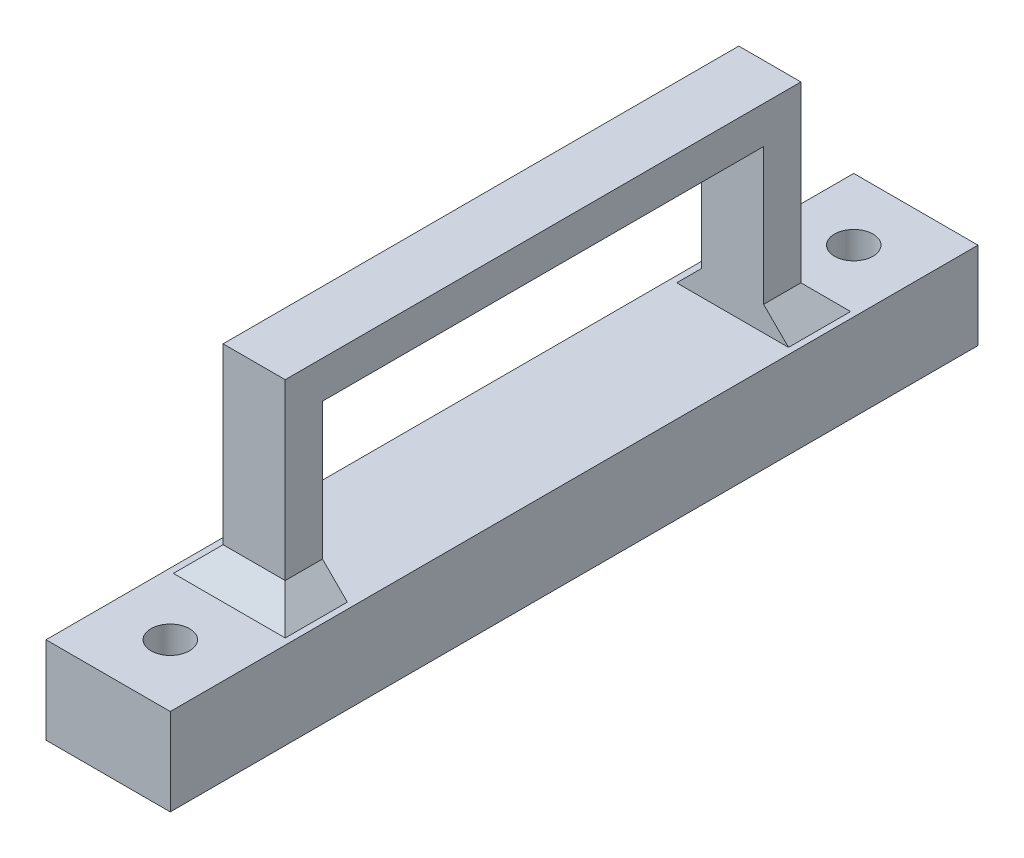
ISO-10303-21;
HEADER;
FILE_DESCRIPTION(('STEP AP214'),'2;1');
FILE_NAME('part.step','',(''),(''),'','','');
FILE_SCHEMA(('AUTOMOTIVE_DESIGN { 1 0 10303 214 1 1 1 1 }'));
ENDSEC;
DATA;
#1=APPLICATION_CONTEXT('core data for automotive mechanical design processes');
#2=APPLICATION_PROTOCOL_DEFINITION('international standard','automotive_design',2000,#1);
#3=PRODUCT_CONTEXT('',#1,'mechanical');
#4=PRODUCT('Part','Part','',(#3));
#5=PRODUCT_RELATED_PRODUCT_CATEGORY('part','',(#4));
#6=PRODUCT_DEFINITION_FORMATION('','',#4);
#7=PRODUCT_DEFINITION_CONTEXT('part definition',#1,'design');
#8=PRODUCT_DEFINITION('design','',#6,#7);
#9=PRODUCT_DEFINITION_SHAPE('','',#8);
#10=(LENGTH_UNIT() NAMED_UNIT(*) SI_UNIT(.MILLI.,.METRE.));
#11=(NAMED_UNIT(*) PLANE_ANGLE_UNIT() SI_UNIT($,.RADIAN.));
#12=(NAMED_UNIT(*) SI_UNIT($,.STERADIAN.) SOLID_ANGLE_UNIT());
#13=UNCERTAINTY_MEASURE_WITH_UNIT(LENGTH_MEASURE(1.E-05),#10,'distance_accuracy_value','');
#14=(GEOMETRIC_REPRESENTATION_CONTEXT(3) GLOBAL_UNCERTAINTY_ASSIGNED_CONTEXT((#13)) GLOBAL_UNIT_ASSIGNED_CONTEXT((#10,
#11,#12)) REPRESENTATION_CONTEXT('',''));
#15=CARTESIAN_POINT('',(0.,0.,0.));
#16=DIRECTION('',(0.,0.,1.));
#17=DIRECTION('',(1.,0.,0.));
#18=AXIS2_PLACEMENT_3D('',#15,#16,#17);
#19=CARTESIAN_POINT('',(7.50000000000001,23.,-50.25));
#20=DIRECTION('',(0.,0.,-1.));
#21=DIRECTION('',(-1.,0.,0.));
#22=AXIS2_PLACEMENT_3D('',#19,#20,#21);
#23=PLANE('',#22);
#24=DIRECTION('',(1.,0.,0.));
#25=VECTOR('',#24,1.);
#26=CARTESIAN_POINT('',(2.5,20.,-50.25));
#27=LINE('',#26,#25);
#28=CARTESIAN_POINT('',(2.5,20.,-50.25));
#29=VERTEX_POINT('',#28);
#30=CARTESIAN_POINT('',(7.50000000000001,20.,-50.25));
#31=VERTEX_POINT('',#30);
#32=EDGE_CURVE('E169',#29,#31,#27,.T.);
#33=ORIENTED_EDGE('',*,*,#32,.F.);
#34=DIRECTION('',(0.,-1.,0.));
#35=VECTOR('',#34,1.);
#36=CARTESIAN_POINT('',(2.5,23.,-50.25));
#37=LINE('',#36,#35);
#38=CARTESIAN_POINT('',(2.5,9.00000000000001,-50.25));
#39=VERTEX_POINT('',#38);
#40=EDGE_CURVE('E179',#29,#39,#37,.T.);
#41=ORIENTED_EDGE('',*,*,#40,.T.);
#42=DIRECTION('',(0.707106781186543,0.707106781186552,0.));
#43=VECTOR('',#42,1.);
#44=CARTESIAN_POINT('',(12.,18.5000000000001,-50.25));
#45=LINE('',#44,#43);
#46=CARTESIAN_POINT('',(0.500000000000007,7.,-50.25));
#47=VERTEX_POINT('',#46);
#48=EDGE_CURVE('E11',#39,#47,#45,.F.);
#49=ORIENTED_EDGE('',*,*,#48,.T.);
#50=DIRECTION('',(1.,0.,0.));
#51=VECTOR('',#50,1.);
#52=CARTESIAN_POINT('',(7.50000000000001,7.,-50.25));
#53=LINE('',#52,#51);
#54=CARTESIAN_POINT('',(9.49999999999999,7.,-50.25));
#55=VERTEX_POINT('',#54);
#56=EDGE_CURVE('E196',#47,#55,#53,.T.);
#57=ORIENTED_EDGE('',*,*,#56,.T.);
#58=DIRECTION('',(0.707106781186543,-0.707106781186552,0.));
#59=VECTOR('',#58,1.);
#60=CARTESIAN_POINT('',(0.500000000000012,16.0000000000001,-50.25));
#61=LINE('',#60,#59);
#62=CARTESIAN_POINT('',(7.50000000000001,9.00000000000001,-50.25));
#63=VERTEX_POINT('',#62);
#64=EDGE_CURVE('E53',#55,#63,#61,.F.);
#65=ORIENTED_EDGE('',*,*,#64,.T.);
#66=DIRECTION('',(0.,-1.,0.));
#67=VECTOR('',#66,1.);
#68=CARTESIAN_POINT('',(7.50000000000001,23.,-50.25));
#69=LINE('',#68,#67);
#70=EDGE_CURVE('E206',#31,#63,#69,.T.);
#71=ORIENTED_EDGE('',*,*,#70,.F.);
#72=EDGE_LOOP('',(#33,#41,#49,#57,#65,#71));
#73=FACE_BOUND('',#72,.T.);
#74=ADVANCED_FACE('F43',(#73),#23,.F.);
#75=CARTESIAN_POINT('',(7.50000000000001,23.,-14.75));
#76=DIRECTION('',(0.,0.,1.));
#77=DIRECTION('',(1.,0.,0.));
#78=AXIS2_PLACEMENT_3D('',#75,#76,#77);
#79=PLANE('',#78);
#80=DIRECTION('',(1.,0.,0.));
#81=VECTOR('',#80,1.);
#82=CARTESIAN_POINT('',(2.5,20.,-14.75));
#83=LINE('',#82,#81);
#84=CARTESIAN_POINT('',(2.5,20.,-14.75));
#85=VERTEX_POINT('',#84);
#86=CARTESIAN_POINT('',(7.50000000000001,20.,-14.75));
#87=VERTEX_POINT('',#86);
#88=EDGE_CURVE('E160',#85,#87,#83,.T.);
#89=ORIENTED_EDGE('',*,*,#88,.T.);
#90=DIRECTION('',(0.,-1.,0.));
#91=VECTOR('',#90,1.);
#92=CARTESIAN_POINT('',(7.50000000000001,23.,-14.75));
#93=LINE('',#92,#91);
#94=CARTESIAN_POINT('',(7.50000000000001,9.00000000000001,-14.75));
#95=VERTEX_POINT('',#94);
#96=EDGE_CURVE('E180',#87,#95,#93,.T.);
#97=ORIENTED_EDGE('',*,*,#96,.T.);
#98=DIRECTION('',(-0.707106781186543,0.707106781186552,0.));
#99=VECTOR('',#98,1.);
#100=CARTESIAN_POINT('',(0.500000000000042,16.0000000000001,-14.75));
#101=LINE('',#100,#99);
#102=CARTESIAN_POINT('',(9.50000000000005,7.,-14.75));
#103=VERTEX_POINT('',#102);
#104=EDGE_CURVE('E285',#95,#103,#101,.F.);
#105=ORIENTED_EDGE('',*,*,#104,.T.);
#106=DIRECTION('',(-1.,0.,0.));
#107=VECTOR('',#106,1.);
#108=CARTESIAN_POINT('',(7.50000000000001,7.,-14.75));
#109=LINE('',#108,#107);
#110=CARTESIAN_POINT('',(0.499999999999946,7.,-14.75));
#111=VERTEX_POINT('',#110);
#112=EDGE_CURVE('E194',#103,#111,#109,.T.);
#113=ORIENTED_EDGE('',*,*,#112,.T.);
#114=DIRECTION('',(-0.707106781186543,-0.707106781186552,0.));
#115=VECTOR('',#114,1.);
#116=CARTESIAN_POINT('',(11.9999999999999,18.5000000000001,-14.75));
#117=LINE('',#116,#115);
#118=CARTESIAN_POINT('',(2.5,9.00000000000001,-14.75));
#119=VERTEX_POINT('',#118);
#120=EDGE_CURVE('E184',#111,#119,#117,.F.);
#121=ORIENTED_EDGE('',*,*,#120,.T.);
#122=DIRECTION('',(0.,-1.,0.));
#123=VECTOR('',#122,1.);
#124=CARTESIAN_POINT('',(2.5,23.,-14.75));
#125=LINE('',#124,#123);
#126=EDGE_CURVE('E176',#85,#119,#125,.T.);
#127=ORIENTED_EDGE('',*,*,#126,.F.);
#128=EDGE_LOOP('',(#89,#97,#105,#113,#121,#127));
#129=FACE_BOUND('',#128,.T.);
#130=ADVANCED_FACE('F182',(#129),#79,.F.);
#131=CARTESIAN_POINT('',(0.,7.,0.));
#132=DIRECTION('',(0.,-1.,0.));
#133=DIRECTION('',(0.,0.,-1.));
#134=AXIS2_PLACEMENT_3D('',#131,#132,#133);
#135=PLANE('',#134);
#136=DIRECTION('',(0.,0.,1.));
#137=VECTOR('',#136,1.);
#138=CARTESIAN_POINT('',(9.49999999999999,7.,-50.25));
#139=LINE('',#138,#137);
#140=CARTESIAN_POINT('',(9.49999999999998,7.,-55.25));
#141=VERTEX_POINT('',#140);
#142=EDGE_CURVE('E266',#141,#55,#139,.T.);
#143=ORIENTED_EDGE('',*,*,#142,.T.);
#144=ORIENTED_EDGE('',*,*,#56,.F.);
#145=DIRECTION('',(0.,0.,-1.));
#146=VECTOR('',#145,1.);
#147=CARTESIAN_POINT('',(0.500000000000013,7.,-53.25));
#148=LINE('',#147,#146);
#149=CARTESIAN_POINT('',(0.500000000000016,7.,-55.25));
#150=VERTEX_POINT('',#149);
#151=EDGE_CURVE('E262',#47,#150,#148,.T.);
#152=ORIENTED_EDGE('',*,*,#151,.T.);
#153=DIRECTION('',(1.,0.,0.));
#154=VECTOR('',#153,1.);
#155=CARTESIAN_POINT('',(7.5,7.,-55.25));
#156=LINE('',#155,#154);
#157=EDGE_CURVE('E264',#150,#141,#156,.T.);
#158=ORIENTED_EDGE('',*,*,#157,.T.);
#159=EDGE_LOOP('',(#143,#144,#152,#158));
#160=FACE_BOUND('',#159,.T.);
#161=DIRECTION('',(0.,0.,1.));
#162=VECTOR('',#161,1.);
#163=CARTESIAN_POINT('',(0.,7.,0.));
#164=LINE('',#163,#162);
#165=CARTESIAN_POINT('',(0.,7.,-65.));
#166=VERTEX_POINT('',#165);
#167=CARTESIAN_POINT('',(0.,7.,0.));
#168=VERTEX_POINT('',#167);
#169=EDGE_CURVE('E229',#166,#168,#164,.T.);
#170=ORIENTED_EDGE('',*,*,#169,.T.);
#171=DIRECTION('',(1.,0.,0.));
#172=VECTOR('',#171,1.);
#173=CARTESIAN_POINT('',(0.,7.,0.));
#174=LINE('',#173,#172);
#175=CARTESIAN_POINT('',(10.,7.,0.));
#176=VERTEX_POINT('',#175);
#177=EDGE_CURVE('E232',#168,#176,#174,.T.);
#178=ORIENTED_EDGE('',*,*,#177,.T.);
#179=DIRECTION('',(0.,0.,-1.));
#180=VECTOR('',#179,1.);
#181=CARTESIAN_POINT('',(10.,7.,0.));
#182=LINE('',#181,#180);
#183=CARTESIAN_POINT('',(10.,7.,-65.));
#184=VERTEX_POINT('',#183);
#185=EDGE_CURVE('E235',#176,#184,#182,.T.);
#186=ORIENTED_EDGE('',*,*,#185,.T.);
#187=DIRECTION('',(-1.,0.,0.));
#188=VECTOR('',#187,1.);
#189=CARTESIAN_POINT('',(0.,7.,-65.));
#190=LINE('',#189,#188);
#191=EDGE_CURVE('E237',#184,#166,#190,.T.);
#192=ORIENTED_EDGE('',*,*,#191,.T.);
#193=EDGE_LOOP('',(#170,#178,#186,#192));
#194=FACE_BOUND('',#193,.T.);
#195=CARTESIAN_POINT('',(5.,7.,-60.));
#196=DIRECTION('',(0.,1.,0.));
#197=DIRECTION('',(0.,0.,1.));
#198=AXIS2_PLACEMENT_3D('',#195,#196,#197);
#199=CIRCLE('',#198,1.55);
#200=CARTESIAN_POINT('',(5.,7.,-58.45));
#201=VERTEX_POINT('',#200);
#202=EDGE_CURVE('E223',#201,#201,#199,.T.);
#203=ORIENTED_EDGE('',*,*,#202,.F.);
#204=EDGE_LOOP('',(#203));
#205=FACE_BOUND('',#204,.T.);
#206=CARTESIAN_POINT('',(5.,7.,-5.));
#207=DIRECTION('',(0.,1.,0.));
#208=DIRECTION('',(0.,0.,1.));
#209=AXIS2_PLACEMENT_3D('',#206,#207,#208);
#210=CIRCLE('',#209,1.55);
#211=CARTESIAN_POINT('',(5.,7.,-3.45));
#212=VERTEX_POINT('',#211);
#213=EDGE_CURVE('E217',#212,#212,#210,.T.);
#214=ORIENTED_EDGE('',*,*,#213,.F.);
#215=EDGE_LOOP('',(#214));
#216=FACE_BOUND('',#215,.T.);
#217=DIRECTION('',(0.,0.,-1.));
#218=VECTOR('',#217,1.);
#219=CARTESIAN_POINT('',(0.499999999999946,7.,-14.75));
#220=LINE('',#219,#218);
#221=CARTESIAN_POINT('',(0.499999999999937,7.,-9.75000000000001));
#222=VERTEX_POINT('',#221);
#223=EDGE_CURVE('E273',#222,#111,#220,.T.);
#224=ORIENTED_EDGE('',*,*,#223,.T.);
#225=ORIENTED_EDGE('',*,*,#112,.F.);
#226=DIRECTION('',(0.,0.,1.));
#227=VECTOR('',#226,1.);
#228=CARTESIAN_POINT('',(9.50000000000006,7.,-11.75));
#229=LINE('',#228,#227);
#230=CARTESIAN_POINT('',(9.50000000000006,7.,-9.75000000000001));
#231=VERTEX_POINT('',#230);
#232=EDGE_CURVE('E271',#103,#231,#229,.T.);
#233=ORIENTED_EDGE('',*,*,#232,.T.);
#234=DIRECTION('',(-1.,0.,0.));
#235=VECTOR('',#234,1.);
#236=CARTESIAN_POINT('',(2.5,7.,-9.75000000000001));
#237=LINE('',#236,#235);
#238=EDGE_CURVE('E269',#231,#222,#237,.T.);
#239=ORIENTED_EDGE('',*,*,#238,.T.);
#240=EDGE_LOOP('',(#224,#225,#233,#239));
#241=FACE_BOUND('',#240,.T.);
#242=ADVANCED_FACE('F320',(#160,#194,#205,#216,#241),#135,.F.);
#243=CARTESIAN_POINT('',(0.,0.,0.));
#244=DIRECTION('',(0.,-1.,0.));
#245=DIRECTION('',(0.,0.,-1.));
#246=AXIS2_PLACEMENT_3D('',#243,#244,#245);
#247=PLANE('',#246);
#248=CARTESIAN_POINT('',(5.,0.,-60.));
#249=DIRECTION('',(0.,1.,0.));
#250=DIRECTION('',(0.,0.,1.));
#251=AXIS2_PLACEMENT_3D('',#248,#249,#250);
#252=CIRCLE('',#251,1.55);
#253=CARTESIAN_POINT('',(5.,0.,-58.45));
#254=VERTEX_POINT('',#253);
#255=EDGE_CURVE('E220',#254,#254,#252,.T.);
#256=ORIENTED_EDGE('',*,*,#255,.T.);
#257=EDGE_LOOP('',(#256));
#258=FACE_BOUND('',#257,.T.);
#259=DIRECTION('',(0.,0.,1.));
#260=VECTOR('',#259,1.);
#261=CARTESIAN_POINT('',(0.,0.,0.));
#262=LINE('',#261,#260);
#263=CARTESIAN_POINT('',(0.,0.,-65.));
#264=VERTEX_POINT('',#263);
#265=CARTESIAN_POINT('',(0.,0.,0.));
#266=VERTEX_POINT('',#265);
#267=EDGE_CURVE('E226',#264,#266,#262,.T.);
#268=ORIENTED_EDGE('',*,*,#267,.F.);
#269=DIRECTION('',(-1.,0.,0.));
#270=VECTOR('',#269,1.);
#271=CARTESIAN_POINT('',(0.,0.,-65.));
#272=LINE('',#271,#270);
#273=CARTESIAN_POINT('',(10.,0.,-65.));
#274=VERTEX_POINT('',#273);
#275=EDGE_CURVE('E233',#274,#264,#272,.T.);
#276=ORIENTED_EDGE('',*,*,#275,.F.);
#277=DIRECTION('',(0.,0.,-1.));
#278=VECTOR('',#277,1.);
#279=CARTESIAN_POINT('',(10.,0.,0.));
#280=LINE('',#279,#278);
#281=CARTESIAN_POINT('',(10.,0.,0.));
#282=VERTEX_POINT('',#281);
#283=EDGE_CURVE('E244',#282,#274,#280,.T.);
#284=ORIENTED_EDGE('',*,*,#283,.F.);
#285=DIRECTION('',(1.,0.,0.));
#286=VECTOR('',#285,1.);
#287=CARTESIAN_POINT('',(0.,0.,0.));
#288=LINE('',#287,#286);
#289=EDGE_CURVE('E242',#266,#282,#288,.T.);
#290=ORIENTED_EDGE('',*,*,#289,.F.);
#291=EDGE_LOOP('',(#268,#276,#284,#290));
#292=FACE_BOUND('',#291,.T.);
#293=CARTESIAN_POINT('',(5.,0.,-5.));
#294=DIRECTION('',(0.,1.,0.));
#295=DIRECTION('',(0.,0.,1.));
#296=AXIS2_PLACEMENT_3D('',#293,#294,#295);
#297=CIRCLE('',#296,1.55);
#298=CARTESIAN_POINT('',(5.,0.,-3.45));
#299=VERTEX_POINT('',#298);
#300=EDGE_CURVE('E216',#299,#299,#297,.T.);
#301=ORIENTED_EDGE('',*,*,#300,.T.);
#302=EDGE_LOOP('',(#301));
#303=FACE_BOUND('',#302,.T.);
#304=ADVANCED_FACE('F340',(#258,#292,#303),#247,.T.);
#305=CARTESIAN_POINT('',(0.,7.,0.));
#306=DIRECTION('',(1.,0.,0.));
#307=DIRECTION('',(0.,0.,-1.));
#308=AXIS2_PLACEMENT_3D('',#305,#306,#307);
#309=PLANE('',#308);
#310=ORIENTED_EDGE('',*,*,#267,.T.);
#311=DIRECTION('',(0.,-1.,0.));
#312=VECTOR('',#311,1.);
#313=CARTESIAN_POINT('',(0.,7.,0.));
#314=LINE('',#313,#312);
#315=EDGE_CURVE('E255',#168,#266,#314,.T.);
#316=ORIENTED_EDGE('',*,*,#315,.F.);
#317=ORIENTED_EDGE('',*,*,#169,.F.);
#318=DIRECTION('',(0.,-1.,0.));
#319=VECTOR('',#318,1.);
#320=CARTESIAN_POINT('',(0.,7.,-65.));
#321=LINE('',#320,#319);
#322=EDGE_CURVE('E239',#166,#264,#321,.T.);
#323=ORIENTED_EDGE('',*,*,#322,.T.);
#324=EDGE_LOOP('',(#310,#316,#317,#323));
#325=FACE_BOUND('',#324,.T.);
#326=ADVANCED_FACE('F357',(#325),#309,.F.);
#327=CARTESIAN_POINT('',(0.,7.,0.));
#328=DIRECTION('',(0.,0.,-1.));
#329=DIRECTION('',(-1.,0.,0.));
#330=AXIS2_PLACEMENT_3D('',#327,#328,#329);
#331=PLANE('',#330);
#332=ORIENTED_EDGE('',*,*,#289,.T.);
#333=DIRECTION('',(0.,-1.,0.));
#334=VECTOR('',#333,1.);
#335=CARTESIAN_POINT('',(10.,7.,0.));
#336=LINE('',#335,#334);
#337=EDGE_CURVE('E252',#176,#282,#336,.T.);
#338=ORIENTED_EDGE('',*,*,#337,.F.);
#339=ORIENTED_EDGE('',*,*,#177,.F.);
#340=ORIENTED_EDGE('',*,*,#315,.T.);
#341=EDGE_LOOP('',(#332,#338,#339,#340));
#342=FACE_BOUND('',#341,.T.);
#343=ADVANCED_FACE('F363',(#342),#331,.F.);
#344=CARTESIAN_POINT('',(10.,7.,0.));
#345=DIRECTION('',(-1.,0.,0.));
#346=DIRECTION('',(0.,0.,1.));
#347=AXIS2_PLACEMENT_3D('',#344,#345,#346);
#348=PLANE('',#347);
#349=ORIENTED_EDGE('',*,*,#283,.T.);
#350=DIRECTION('',(0.,-1.,0.));
#351=VECTOR('',#350,1.);
#352=CARTESIAN_POINT('',(10.,7.,-65.));
#353=LINE('',#352,#351);
#354=EDGE_CURVE('E249',#184,#274,#353,.T.);
#355=ORIENTED_EDGE('',*,*,#354,.F.);
#356=ORIENTED_EDGE('',*,*,#185,.F.);
#357=ORIENTED_EDGE('',*,*,#337,.T.);
#358=EDGE_LOOP('',(#349,#355,#356,#357));
#359=FACE_BOUND('',#358,.T.);
#360=ADVANCED_FACE('F389',(#359),#348,.F.);
#361=CARTESIAN_POINT('',(0.,7.,-65.));
#362=DIRECTION('',(0.,0.,1.));
#363=DIRECTION('',(1.,0.,0.));
#364=AXIS2_PLACEMENT_3D('',#361,#362,#363);
#365=PLANE('',#364);
#366=ORIENTED_EDGE('',*,*,#275,.T.);
#367=ORIENTED_EDGE('',*,*,#322,.F.);
#368=ORIENTED_EDGE('',*,*,#191,.F.);
#369=ORIENTED_EDGE('',*,*,#354,.T.);
#370=EDGE_LOOP('',(#366,#367,#368,#369));
#371=FACE_BOUND('',#370,.T.);
#372=ADVANCED_FACE('F384',(#371),#365,.F.);
#373=CARTESIAN_POINT('',(5.,7.,-60.));
#374=DIRECTION('',(0.,-1.,0.));
#375=DIRECTION('',(0.,0.,-1.));
#376=AXIS2_PLACEMENT_3D('',#373,#374,#375);
#377=CYLINDRICAL_SURFACE('',#376,1.55);
#378=ORIENTED_EDGE('',*,*,#202,.T.);
#379=EDGE_LOOP('',(#378));
#380=FACE_BOUND('',#379,.T.);
#381=ORIENTED_EDGE('',*,*,#255,.F.);
#382=EDGE_LOOP('',(#381));
#383=FACE_BOUND('',#382,.T.);
#384=ADVANCED_FACE('F352',(#380,#383),#377,.F.);
#385=CARTESIAN_POINT('',(5.,7.,-5.));
#386=DIRECTION('',(0.,-1.,0.));
#387=DIRECTION('',(0.,0.,-1.));
#388=AXIS2_PLACEMENT_3D('',#385,#386,#387);
#389=CYLINDRICAL_SURFACE('',#388,1.55);
#390=ORIENTED_EDGE('',*,*,#213,.T.);
#391=EDGE_LOOP('',(#390));
#392=FACE_BOUND('',#391,.T.);
#393=ORIENTED_EDGE('',*,*,#300,.F.);
#394=EDGE_LOOP('',(#393));
#395=FACE_BOUND('',#394,.T.);
#396=ADVANCED_FACE('F349',(#392,#395),#389,.F.);
#397=CARTESIAN_POINT('',(7.5,23.,-53.25));
#398=DIRECTION('',(-1.,0.,0.));
#399=DIRECTION('',(0.,0.,1.));
#400=AXIS2_PLACEMENT_3D('',#397,#398,#399);
#401=PLANE('',#400);
#402=DIRECTION('',(0.,-1.,0.));
#403=VECTOR('',#402,1.);
#404=CARTESIAN_POINT('',(7.5,23.,-11.75));
#405=LINE('',#404,#403);
#406=CARTESIAN_POINT('',(7.5,23.,-11.75));
#407=VERTEX_POINT('',#406);
#408=CARTESIAN_POINT('',(7.5,9.00000000000001,-11.75));
#409=VERTEX_POINT('',#408);
#410=EDGE_CURVE('E188',#407,#409,#405,.T.);
#411=ORIENTED_EDGE('',*,*,#410,.T.);
#412=DIRECTION('',(0.,0.,-1.));
#413=VECTOR('',#412,1.);
#414=CARTESIAN_POINT('',(7.50000000000007,9.00000000000001,-14.75));
#415=LINE('',#414,#413);
#416=EDGE_CURVE('E68',#409,#95,#415,.T.);
#417=ORIENTED_EDGE('',*,*,#416,.T.);
#418=ORIENTED_EDGE('',*,*,#96,.F.);
#419=DIRECTION('',(0.,0.,-1.));
#420=VECTOR('',#419,1.);
#421=CARTESIAN_POINT('',(7.50000000000001,20.,-14.75));
#422=LINE('',#421,#420);
#423=EDGE_CURVE('E166',#87,#31,#422,.T.);
#424=ORIENTED_EDGE('',*,*,#423,.T.);
#425=ORIENTED_EDGE('',*,*,#70,.T.);
#426=DIRECTION('',(0.,0.,-1.));
#427=VECTOR('',#426,1.);
#428=CARTESIAN_POINT('',(7.5,9.00000000000001,-53.25));
#429=LINE('',#428,#427);
#430=CARTESIAN_POINT('',(7.5,9.00000000000001,-53.25));
#431=VERTEX_POINT('',#430);
#432=EDGE_CURVE('E276',#63,#431,#429,.T.);
#433=ORIENTED_EDGE('',*,*,#432,.T.);
#434=DIRECTION('',(0.,-1.,0.));
#435=VECTOR('',#434,1.);
#436=CARTESIAN_POINT('',(7.5,23.,-53.25));
#437=LINE('',#436,#435);
#438=CARTESIAN_POINT('',(7.5,23.,-53.25));
#439=VERTEX_POINT('',#438);
#440=EDGE_CURVE('E213',#439,#431,#437,.T.);
#441=ORIENTED_EDGE('',*,*,#440,.F.);
#442=DIRECTION('',(0.,0.,-1.));
#443=VECTOR('',#442,1.);
#444=CARTESIAN_POINT('',(7.5,23.,-53.25));
#445=LINE('',#444,#443);
#446=EDGE_CURVE('E199',#407,#439,#445,.T.);
#447=ORIENTED_EDGE('',*,*,#446,.F.);
#448=EDGE_LOOP('',(#411,#417,#418,#424,#425,#433,#441,#447));
#449=FACE_BOUND('',#448,.T.);
#450=ADVANCED_FACE('F312',(#449),#401,.F.);
#451=CARTESIAN_POINT('',(7.5,23.,-53.25));
#452=DIRECTION('',(0.,0.,1.));
#453=DIRECTION('',(1.,0.,0.));
#454=AXIS2_PLACEMENT_3D('',#451,#452,#453);
#455=PLANE('',#454);
#456=ORIENTED_EDGE('',*,*,#440,.T.);
#457=DIRECTION('',(-1.,0.,0.));
#458=VECTOR('',#457,1.);
#459=CARTESIAN_POINT('',(2.5,9.00000000000001,-53.25));
#460=LINE('',#459,#458);
#461=CARTESIAN_POINT('',(2.5,9.00000000000001,-53.25));
#462=VERTEX_POINT('',#461);
#463=EDGE_CURVE('E282',#431,#462,#460,.T.);
#464=ORIENTED_EDGE('',*,*,#463,.T.);
#465=DIRECTION('',(0.,-1.,0.));
#466=VECTOR('',#465,1.);
#467=CARTESIAN_POINT('',(2.5,23.,-53.25));
#468=LINE('',#467,#466);
#469=CARTESIAN_POINT('',(2.5,23.,-53.25));
#470=VERTEX_POINT('',#469);
#471=EDGE_CURVE('E210',#470,#462,#468,.T.);
#472=ORIENTED_EDGE('',*,*,#471,.F.);
#473=DIRECTION('',(-1.,0.,0.));
#474=VECTOR('',#473,1.);
#475=CARTESIAN_POINT('',(7.5,23.,-53.25));
#476=LINE('',#475,#474);
#477=EDGE_CURVE('E202',#439,#470,#476,.T.);
#478=ORIENTED_EDGE('',*,*,#477,.F.);
#479=EDGE_LOOP('',(#456,#464,#472,#478));
#480=FACE_BOUND('',#479,.T.);
#481=ADVANCED_FACE('F335',(#480),#455,.F.);
#482=CARTESIAN_POINT('',(2.5,23.,-53.25));
#483=DIRECTION('',(1.,0.,0.));
#484=DIRECTION('',(0.,0.,-1.));
#485=AXIS2_PLACEMENT_3D('',#482,#483,#484);
#486=PLANE('',#485);
#487=ORIENTED_EDGE('',*,*,#126,.T.);
#488=DIRECTION('',(0.,0.,1.));
#489=VECTOR('',#488,1.);
#490=CARTESIAN_POINT('',(2.49999999999993,9.00000000000001,-11.75));
#491=LINE('',#490,#489);
#492=CARTESIAN_POINT('',(2.5,9.00000000000001,-11.75));
#493=VERTEX_POINT('',#492);
#494=EDGE_CURVE('E260',#119,#493,#491,.T.);
#495=ORIENTED_EDGE('',*,*,#494,.T.);
#496=DIRECTION('',(0.,-1.,0.));
#497=VECTOR('',#496,1.);
#498=CARTESIAN_POINT('',(2.5,23.,-11.75));
#499=LINE('',#498,#497);
#500=CARTESIAN_POINT('',(2.5,23.,-11.75));
#501=VERTEX_POINT('',#500);
#502=EDGE_CURVE('E185',#501,#493,#499,.T.);
#503=ORIENTED_EDGE('',*,*,#502,.F.);
#504=DIRECTION('',(0.,0.,1.));
#505=VECTOR('',#504,1.);
#506=CARTESIAN_POINT('',(2.5,23.,-53.25));
#507=LINE('',#506,#505);
#508=EDGE_CURVE('E204',#470,#501,#507,.T.);
#509=ORIENTED_EDGE('',*,*,#508,.F.);
#510=ORIENTED_EDGE('',*,*,#471,.T.);
#511=DIRECTION('',(0.,0.,1.));
#512=VECTOR('',#511,1.);
#513=CARTESIAN_POINT('',(2.5,9.00000000000001,-50.25));
#514=LINE('',#513,#512);
#515=EDGE_CURVE('E258',#462,#39,#514,.T.);
#516=ORIENTED_EDGE('',*,*,#515,.T.);
#517=ORIENTED_EDGE('',*,*,#40,.F.);
#518=DIRECTION('',(0.,0.,-1.));
#519=VECTOR('',#518,1.);
#520=CARTESIAN_POINT('',(2.5,20.,-14.75));
#521=LINE('',#520,#519);
#522=EDGE_CURVE('E163',#85,#29,#521,.T.);
#523=ORIENTED_EDGE('',*,*,#522,.F.);
#524=EDGE_LOOP('',(#487,#495,#503,#509,#510,#516,#517,#523));
#525=FACE_BOUND('',#524,.T.);
#526=ADVANCED_FACE('F174',(#525),#486,.F.);
#527=CARTESIAN_POINT('',(0.,23.,0.));
#528=DIRECTION('',(0.,-1.,0.));
#529=DIRECTION('',(0.,0.,-1.));
#530=AXIS2_PLACEMENT_3D('',#527,#528,#529);
#531=PLANE('',#530);
#532=ORIENTED_EDGE('',*,*,#446,.T.);
#533=ORIENTED_EDGE('',*,*,#477,.T.);
#534=ORIENTED_EDGE('',*,*,#508,.T.);
#535=DIRECTION('',(1.,0.,0.));
#536=VECTOR('',#535,1.);
#537=CARTESIAN_POINT('',(7.5,23.,-11.75));
#538=LINE('',#537,#536);
#539=EDGE_CURVE('E193',#501,#407,#538,.T.);
#540=ORIENTED_EDGE('',*,*,#539,.T.);
#541=EDGE_LOOP('',(#532,#533,#534,#540));
#542=FACE_BOUND('',#541,.T.);
#543=ADVANCED_FACE('F332',(#542),#531,.F.);
#544=CARTESIAN_POINT('',(7.5,23.,-11.75));
#545=DIRECTION('',(0.,0.,-1.));
#546=DIRECTION('',(-1.,0.,0.));
#547=AXIS2_PLACEMENT_3D('',#544,#545,#546);
#548=PLANE('',#547);
#549=ORIENTED_EDGE('',*,*,#502,.T.);
#550=DIRECTION('',(1.,0.,0.));
#551=VECTOR('',#550,1.);
#552=CARTESIAN_POINT('',(7.5,9.00000000000001,-11.75));
#553=LINE('',#552,#551);
#554=EDGE_CURVE('E280',#493,#409,#553,.T.);
#555=ORIENTED_EDGE('',*,*,#554,.T.);
#556=ORIENTED_EDGE('',*,*,#410,.F.);
#557=ORIENTED_EDGE('',*,*,#539,.F.);
#558=EDGE_LOOP('',(#549,#555,#556,#557));
#559=FACE_BOUND('',#558,.T.);
#560=ADVANCED_FACE('F329',(#559),#548,.F.);
#561=CARTESIAN_POINT('',(2.5,20.,-14.75));
#562=DIRECTION('',(0.,1.,0.));
#563=DIRECTION('',(0.,0.,1.));
#564=AXIS2_PLACEMENT_3D('',#561,#562,#563);
#565=PLANE('',#564);
#566=ORIENTED_EDGE('',*,*,#32,.T.);
#567=ORIENTED_EDGE('',*,*,#423,.F.);
#568=ORIENTED_EDGE('',*,*,#88,.F.);
#569=ORIENTED_EDGE('',*,*,#522,.T.);
#570=EDGE_LOOP('',(#566,#567,#568,#569));
#571=FACE_BOUND('',#570,.T.);
#572=ADVANCED_FACE('F162',(#571),#565,.F.);
#573=CARTESIAN_POINT('',(7.5,9.00000000000001,-53.25));
#574=DIRECTION('',(0.707106781186552,0.707106781186543,0.));
#575=DIRECTION('',(0.,0.,1.));
#576=AXIS2_PLACEMENT_3D('',#573,#574,#575);
#577=PLANE('',#576);
#578=ORIENTED_EDGE('',*,*,#104,.F.);
#579=ORIENTED_EDGE('',*,*,#416,.F.);
#580=DIRECTION('',(-0.577350269189624,0.577350269189631,-0.577350269189623));
#581=VECTOR('',#580,1.);
#582=CARTESIAN_POINT('',(7.50000000000005,9.00000000000004,-11.75));
#583=LINE('',#582,#581);
#584=EDGE_CURVE('E291',#231,#409,#583,.T.);
#585=ORIENTED_EDGE('',*,*,#584,.F.);
#586=ORIENTED_EDGE('',*,*,#232,.F.);
#587=EDGE_LOOP('',(#578,#579,#585,#586));
#588=FACE_BOUND('',#587,.T.);
#589=ADVANCED_FACE('F316',(#588),#577,.T.);
#590=CARTESIAN_POINT('',(7.5,9.00000000000001,-11.75));
#591=DIRECTION('',(0.,0.707106781186543,0.707106781186552));
#592=DIRECTION('',(-1.,0.,0.));
#593=AXIS2_PLACEMENT_3D('',#590,#591,#592);
#594=PLANE('',#593);
#595=ORIENTED_EDGE('',*,*,#584,.T.);
#596=ORIENTED_EDGE('',*,*,#554,.F.);
#597=DIRECTION('',(-0.577350269189624,-0.577350269189631,0.577350269189623));
#598=VECTOR('',#597,1.);
#599=CARTESIAN_POINT('',(4.16666666666661,10.6666666666667,-13.4166666666667));
#600=LINE('',#599,#598);
#601=EDGE_CURVE('E289',#222,#493,#600,.F.);
#602=ORIENTED_EDGE('',*,*,#601,.F.);
#603=ORIENTED_EDGE('',*,*,#238,.F.);
#604=EDGE_LOOP('',(#595,#596,#602,#603));
#605=FACE_BOUND('',#604,.T.);
#606=ADVANCED_FACE('F408',(#605),#594,.T.);
#607=CARTESIAN_POINT('',(2.5,9.00000000000001,-53.25));
#608=DIRECTION('',(-0.707106781186552,0.707106781186543,0.));
#609=DIRECTION('',(0.,0.,-1.));
#610=AXIS2_PLACEMENT_3D('',#607,#608,#609);
#611=PLANE('',#610);
#612=ORIENTED_EDGE('',*,*,#120,.F.);
#613=ORIENTED_EDGE('',*,*,#223,.F.);
#614=ORIENTED_EDGE('',*,*,#601,.T.);
#615=ORIENTED_EDGE('',*,*,#494,.F.);
#616=EDGE_LOOP('',(#612,#613,#614,#615));
#617=FACE_BOUND('',#616,.T.);
#618=ADVANCED_FACE('F324',(#617),#611,.T.);
#619=CARTESIAN_POINT('',(2.5,9.00000000000001,-53.25));
#620=DIRECTION('',(-0.707106781186552,0.707106781186543,0.));
#621=DIRECTION('',(0.,0.,-1.));
#622=AXIS2_PLACEMENT_3D('',#619,#620,#621);
#623=PLANE('',#622);
#624=ORIENTED_EDGE('',*,*,#48,.F.);
#625=ORIENTED_EDGE('',*,*,#515,.F.);
#626=DIRECTION('',(-0.577350269189623,-0.577350269189631,-0.577350269189624));
#627=VECTOR('',#626,1.);
#628=CARTESIAN_POINT('',(2.5,9.00000000000001,-53.25));
#629=LINE('',#628,#627);
#630=EDGE_CURVE('E48',#150,#462,#629,.F.);
#631=ORIENTED_EDGE('',*,*,#630,.F.);
#632=ORIENTED_EDGE('',*,*,#151,.F.);
#633=EDGE_LOOP('',(#624,#625,#631,#632));
#634=FACE_BOUND('',#633,.T.);
#635=ADVANCED_FACE('F46',(#634),#623,.T.);
#636=CARTESIAN_POINT('',(7.5,9.00000000000001,-53.25));
#637=DIRECTION('',(0.,0.707106781186543,-0.707106781186552));
#638=DIRECTION('',(1.,0.,0.));
#639=AXIS2_PLACEMENT_3D('',#636,#637,#638);
#640=PLANE('',#639);
#641=ORIENTED_EDGE('',*,*,#630,.T.);
#642=ORIENTED_EDGE('',*,*,#463,.F.);
#643=DIRECTION('',(0.577350269189622,-0.577350269189631,-0.577350269189624));
#644=VECTOR('',#643,1.);
#645=CARTESIAN_POINT('',(7.5,9.00000000000001,-53.25));
#646=LINE('',#645,#644);
#647=EDGE_CURVE('E293',#141,#431,#646,.F.);
#648=ORIENTED_EDGE('',*,*,#647,.F.);
#649=ORIENTED_EDGE('',*,*,#157,.F.);
#650=EDGE_LOOP('',(#641,#642,#648,#649));
#651=FACE_BOUND('',#650,.T.);
#652=ADVANCED_FACE('F303',(#651),#640,.T.);
#653=CARTESIAN_POINT('',(7.5,9.00000000000001,-53.25));
#654=DIRECTION('',(0.707106781186552,0.707106781186543,0.));
#655=DIRECTION('',(0.,0.,1.));
#656=AXIS2_PLACEMENT_3D('',#653,#654,#655);
#657=PLANE('',#656);
#658=ORIENTED_EDGE('',*,*,#64,.F.);
#659=ORIENTED_EDGE('',*,*,#142,.F.);
#660=ORIENTED_EDGE('',*,*,#647,.T.);
#661=ORIENTED_EDGE('',*,*,#432,.F.);
#662=EDGE_LOOP('',(#658,#659,#660,#661));
#663=FACE_BOUND('',#662,.T.);
#664=ADVANCED_FACE('F336',(#663),#657,.T.);
#665=CLOSED_SHELL('',(#74,#130,#242,#304,#326,#343,#360,#372,#384,#396,#450,#481,#526,#543,#560,
#572,#589,#606,#618,#635,#652,#664));
#666=MANIFOLD_SOLID_BREP('B2',#665);
#667=ADVANCED_BREP_SHAPE_REPRESENTATION('',(#18,#666),#14);
#668=SHAPE_DEFINITION_REPRESENTATION(#9,#667);
ENDSEC;
END-ISO-10303-21;
